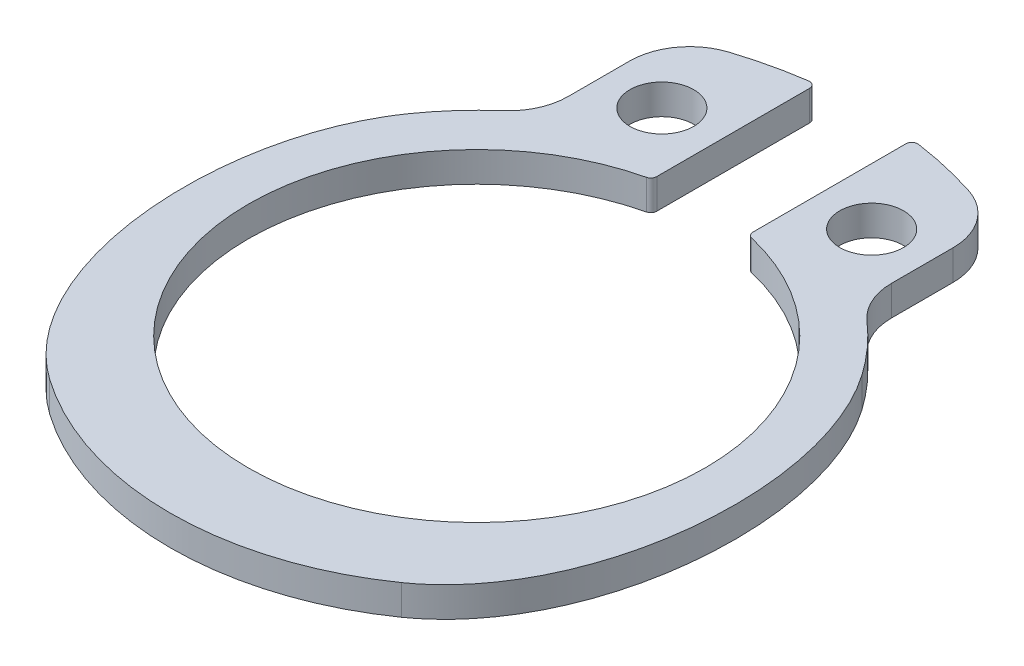
ISO-10303-21;
HEADER;
FILE_DESCRIPTION(('STEP AP214'),'2;1');
FILE_NAME('part.step','',(''),(''),'','','');
FILE_SCHEMA(('AUTOMOTIVE_DESIGN { 1 0 10303 214 1 1 1 1 }'));
ENDSEC;
DATA;
#1=APPLICATION_CONTEXT('core data for automotive mechanical design processes');
#2=APPLICATION_PROTOCOL_DEFINITION('international standard','automotive_design',2000,#1);
#3=PRODUCT_CONTEXT('',#1,'mechanical');
#4=PRODUCT('Part','Part','',(#3));
#5=PRODUCT_RELATED_PRODUCT_CATEGORY('part','',(#4));
#6=PRODUCT_DEFINITION_FORMATION('','',#4);
#7=PRODUCT_DEFINITION_CONTEXT('part definition',#1,'design');
#8=PRODUCT_DEFINITION('design','',#6,#7);
#9=PRODUCT_DEFINITION_SHAPE('','',#8);
#10=(LENGTH_UNIT() NAMED_UNIT(*) SI_UNIT(.MILLI.,.METRE.));
#11=(NAMED_UNIT(*) PLANE_ANGLE_UNIT() SI_UNIT($,.RADIAN.));
#12=(NAMED_UNIT(*) SI_UNIT($,.STERADIAN.) SOLID_ANGLE_UNIT());
#13=UNCERTAINTY_MEASURE_WITH_UNIT(LENGTH_MEASURE(1.E-05),#10,'distance_accuracy_value','');
#14=(GEOMETRIC_REPRESENTATION_CONTEXT(3) GLOBAL_UNCERTAINTY_ASSIGNED_CONTEXT((#13)) GLOBAL_UNIT_ASSIGNED_CONTEXT((#10,
#11,#12)) REPRESENTATION_CONTEXT('',''));
#15=CARTESIAN_POINT('',(0.,0.,0.));
#16=DIRECTION('',(0.,0.,1.));
#17=DIRECTION('',(1.,0.,0.));
#18=AXIS2_PLACEMENT_3D('',#15,#16,#17);
#19=CARTESIAN_POINT('',(-0.45,-0.125,-3.168201382488));
#20=DIRECTION('',(0.,1.,0.));
#21=DIRECTION('',(0.,0.,-1.));
#22=AXIS2_PLACEMENT_3D('',#19,#20,#21);
#23=CYLINDRICAL_SURFACE('',#22,0.0500000000000001);
#24=CARTESIAN_POINT('',(-0.45,0.125,-3.168201382488));
#25=DIRECTION('',(0.,-1.,0.));
#26=DIRECTION('',(0.,0.,-1.));
#27=AXIS2_PLACEMENT_3D('',#24,#25,#26);
#28=CIRCLE('',#27,0.0500000000000001);
#29=CARTESIAN_POINT('',(-0.457031249999959,0.125,-3.21770452908938));
#30=VERTEX_POINT('',#29);
#31=CARTESIAN_POINT('',(-0.4,0.125,-3.168201382488));
#32=VERTEX_POINT('',#31);
#33=EDGE_CURVE('E205',#30,#32,#28,.T.);
#34=ORIENTED_EDGE('',*,*,#33,.T.);
#35=DIRECTION('',(0.,1.,0.));
#36=VECTOR('',#35,1.);
#37=CARTESIAN_POINT('',(-0.4,-0.125,-3.168201382488));
#38=LINE('',#37,#36);
#39=CARTESIAN_POINT('',(-0.4,-0.125,-3.168201382488));
#40=VERTEX_POINT('',#39);
#41=EDGE_CURVE('E40',#40,#32,#38,.T.);
#42=ORIENTED_EDGE('',*,*,#41,.F.);
#43=CARTESIAN_POINT('',(-0.45,-0.125,-3.168201382488));
#44=DIRECTION('',(0.,-1.,0.));
#45=DIRECTION('',(0.,0.,-1.));
#46=AXIS2_PLACEMENT_3D('',#43,#44,#45);
#47=CIRCLE('',#46,0.0500000000000001);
#48=CARTESIAN_POINT('',(-0.457031249999959,-0.125,-3.21770452908938));
#49=VERTEX_POINT('',#48);
#50=EDGE_CURVE('E253',#49,#40,#47,.T.);
#51=ORIENTED_EDGE('',*,*,#50,.F.);
#52=DIRECTION('',(0.,1.,0.));
#53=VECTOR('',#52,1.);
#54=CARTESIAN_POINT('',(-0.457031249999959,-0.125,-3.21770452908938));
#55=LINE('',#54,#53);
#56=EDGE_CURVE('E11',#49,#30,#55,.T.);
#57=ORIENTED_EDGE('',*,*,#56,.T.);
#58=EDGE_LOOP('',(#34,#42,#51,#57));
#59=FACE_BOUND('',#58,.T.);
#60=ADVANCED_FACE('F37',(#59),#23,.T.);
#61=CARTESIAN_POINT('',(0.,-0.125,0.));
#62=DIRECTION('',(0.,1.,0.));
#63=DIRECTION('',(0.,0.,-1.));
#64=AXIS2_PLACEMENT_3D('',#61,#62,#63);
#65=CYLINDRICAL_SURFACE('',#64,3.24999999999982);
#66=CARTESIAN_POINT('',(0.,0.125,0.));
#67=DIRECTION('',(0.,-1.,0.));
#68=DIRECTION('',(0.,0.,-1.));
#69=AXIS2_PLACEMENT_3D('',#66,#67,#68);
#70=CIRCLE('',#69,3.24999999999982);
#71=CARTESIAN_POINT('',(-0.998636363636399,0.125,-3.0927698610181));
#72=VERTEX_POINT('',#71);
#73=EDGE_CURVE('E126',#72,#30,#70,.T.);
#74=ORIENTED_EDGE('',*,*,#73,.T.);
#75=ORIENTED_EDGE('',*,*,#56,.F.);
#76=CARTESIAN_POINT('',(0.,-0.125,0.));
#77=DIRECTION('',(0.,-1.,0.));
#78=DIRECTION('',(0.,0.,-1.));
#79=AXIS2_PLACEMENT_3D('',#76,#77,#78);
#80=CIRCLE('',#79,3.24999999999982);
#81=CARTESIAN_POINT('',(-0.998636363636399,-0.125,-3.0927698610181));
#82=VERTEX_POINT('',#81);
#83=EDGE_CURVE('E55',#82,#49,#80,.T.);
#84=ORIENTED_EDGE('',*,*,#83,.F.);
#85=DIRECTION('',(0.,1.,0.));
#86=VECTOR('',#85,1.);
#87=CARTESIAN_POINT('',(-0.998636363636399,-0.125,-3.0927698610181));
#88=LINE('',#87,#86);
#89=EDGE_CURVE('E46',#82,#72,#88,.T.);
#90=ORIENTED_EDGE('',*,*,#89,.T.);
#91=EDGE_LOOP('',(#74,#75,#84,#90));
#92=FACE_BOUND('',#91,.T.);
#93=ADVANCED_FACE('F401',(#92),#65,.T.);
#94=CARTESIAN_POINT('',(-0.845,-0.125,-2.616959113169));
#95=DIRECTION('',(0.,1.,0.));
#96=DIRECTION('',(0.,0.,-1.));
#97=AXIS2_PLACEMENT_3D('',#94,#95,#96);
#98=CYLINDRICAL_SURFACE('',#97,0.500000000000134);
#99=CARTESIAN_POINT('',(-0.845,0.125,-2.616959113169));
#100=DIRECTION('',(0.,-1.,0.));
#101=DIRECTION('',(0.,0.,-1.));
#102=AXIS2_PLACEMENT_3D('',#99,#100,#101);
#103=CIRCLE('',#102,0.500000000000134);
#104=CARTESIAN_POINT('',(-1.34500000000013,0.125,-2.61695911316899));
#105=VERTEX_POINT('',#104);
#106=EDGE_CURVE('E120',#105,#72,#103,.T.);
#107=ORIENTED_EDGE('',*,*,#106,.T.);
#108=ORIENTED_EDGE('',*,*,#89,.F.);
#109=CARTESIAN_POINT('',(-0.845,-0.125,-2.616959113169));
#110=DIRECTION('',(0.,-1.,0.));
#111=DIRECTION('',(0.,0.,-1.));
#112=AXIS2_PLACEMENT_3D('',#109,#110,#111);
#113=CIRCLE('',#112,0.500000000000134);
#114=CARTESIAN_POINT('',(-1.34500000000013,-0.125,-2.61695911316899));
#115=VERTEX_POINT('',#114);
#116=EDGE_CURVE('E187',#115,#82,#113,.T.);
#117=ORIENTED_EDGE('',*,*,#116,.F.);
#118=DIRECTION('',(0.,1.,0.));
#119=VECTOR('',#118,1.);
#120=CARTESIAN_POINT('',(-1.34500000000013,-0.125,-2.61695911316899));
#121=LINE('',#120,#119);
#122=EDGE_CURVE('E194',#115,#105,#121,.T.);
#123=ORIENTED_EDGE('',*,*,#122,.T.);
#124=EDGE_LOOP('',(#107,#108,#117,#123));
#125=FACE_BOUND('',#124,.T.);
#126=ADVANCED_FACE('F200',(#125),#98,.T.);
#127=CARTESIAN_POINT('',(-1.34500000000013,-0.125,-2.10617544378409));
#128=DIRECTION('',(-1.,0.,0.));
#129=DIRECTION('',(0.,0.,-1.));
#130=AXIS2_PLACEMENT_3D('',#127,#128,#129);
#131=PLANE('',#130);
#132=DIRECTION('',(0.,0.,-1.));
#133=VECTOR('',#132,1.);
#134=CARTESIAN_POINT('',(-1.34500000000013,0.125,-2.10617544378409));
#135=LINE('',#134,#133);
#136=CARTESIAN_POINT('',(-1.34500000000013,0.125,-2.10617544378409));
#137=VERTEX_POINT('',#136);
#138=EDGE_CURVE('E197',#137,#105,#135,.T.);
#139=ORIENTED_EDGE('',*,*,#138,.T.);
#140=ORIENTED_EDGE('',*,*,#122,.F.);
#141=DIRECTION('',(0.,0.,-1.));
#142=VECTOR('',#141,1.);
#143=CARTESIAN_POINT('',(-1.34500000000013,-0.125,-2.10617544378409));
#144=LINE('',#143,#142);
#145=CARTESIAN_POINT('',(-1.34500000000013,-0.125,-2.10617544378409));
#146=VERTEX_POINT('',#145);
#147=EDGE_CURVE('E183',#146,#115,#144,.T.);
#148=ORIENTED_EDGE('',*,*,#147,.F.);
#149=DIRECTION('',(0.,1.,0.));
#150=VECTOR('',#149,1.);
#151=CARTESIAN_POINT('',(-1.34500000000013,-0.125,-2.10617544378409));
#152=LINE('',#151,#150);
#153=EDGE_CURVE('E198',#146,#137,#152,.T.);
#154=ORIENTED_EDGE('',*,*,#153,.T.);
#155=EDGE_LOOP('',(#139,#140,#148,#154));
#156=FACE_BOUND('',#155,.T.);
#157=ADVANCED_FACE('F195',(#156),#131,.T.);
#158=CARTESIAN_POINT('',(-1.84500000000007,-0.125,-2.10617544378409));
#159=DIRECTION('',(0.,1.,0.));
#160=DIRECTION('',(0.,0.,-1.));
#161=AXIS2_PLACEMENT_3D('',#158,#159,#160);
#162=CYLINDRICAL_SURFACE('',#161,0.499999999999943);
#163=CARTESIAN_POINT('',(-1.84500000000007,0.125,-2.10617544378409));
#164=DIRECTION('',(0.,1.,0.));
#165=DIRECTION('',(0.,0.,1.));
#166=AXIS2_PLACEMENT_3D('',#163,#164,#165);
#167=CIRCLE('',#166,0.499999999999943);
#168=CARTESIAN_POINT('',(-1.51553571428582,0.125,-1.73007268596555));
#169=VERTEX_POINT('',#168);
#170=EDGE_CURVE('E249',#169,#137,#167,.T.);
#171=ORIENTED_EDGE('',*,*,#170,.T.);
#172=ORIENTED_EDGE('',*,*,#153,.F.);
#173=CARTESIAN_POINT('',(-1.84500000000007,-0.125,-2.10617544378409));
#174=DIRECTION('',(0.,1.,0.));
#175=DIRECTION('',(0.,0.,1.));
#176=AXIS2_PLACEMENT_3D('',#173,#174,#175);
#177=CIRCLE('',#176,0.499999999999943);
#178=CARTESIAN_POINT('',(-1.51553571428582,-0.125,-1.73007268596555));
#179=VERTEX_POINT('',#178);
#180=EDGE_CURVE('E189',#179,#146,#177,.T.);
#181=ORIENTED_EDGE('',*,*,#180,.F.);
#182=DIRECTION('',(0.,1.,0.));
#183=VECTOR('',#182,1.);
#184=CARTESIAN_POINT('',(-1.51553571428582,-0.125,-1.73007268596555));
#185=LINE('',#184,#183);
#186=EDGE_CURVE('E257',#179,#169,#185,.T.);
#187=ORIENTED_EDGE('',*,*,#186,.T.);
#188=EDGE_LOOP('',(#171,#172,#181,#187));
#189=FACE_BOUND('',#188,.T.);
#190=ADVANCED_FACE('F414',(#189),#162,.F.);
#191=CARTESIAN_POINT('',(0.,-0.125,0.));
#192=DIRECTION('',(0.,1.,0.));
#193=DIRECTION('',(0.,0.,-1.));
#194=AXIS2_PLACEMENT_3D('',#191,#192,#193);
#195=CYLINDRICAL_SURFACE('',#194,2.29999999999997);
#196=CARTESIAN_POINT('',(0.,0.125,0.));
#197=DIRECTION('',(0.,-1.,0.));
#198=DIRECTION('',(0.,0.,-1.));
#199=AXIS2_PLACEMENT_3D('',#196,#197,#198);
#200=CIRCLE('',#199,2.29999999999997);
#201=CARTESIAN_POINT('',(-1.88404970186493,0.125,-1.31922580360695));
#202=VERTEX_POINT('',#201);
#203=EDGE_CURVE('E244',#202,#169,#200,.T.);
#204=ORIENTED_EDGE('',*,*,#203,.T.);
#205=ORIENTED_EDGE('',*,*,#186,.F.);
#206=CARTESIAN_POINT('',(0.,-0.125,0.));
#207=DIRECTION('',(0.,-1.,0.));
#208=DIRECTION('',(0.,0.,-1.));
#209=AXIS2_PLACEMENT_3D('',#206,#207,#208);
#210=CIRCLE('',#209,2.29999999999997);
#211=CARTESIAN_POINT('',(-1.88404970186493,-0.125,-1.31922580360695));
#212=VERTEX_POINT('',#211);
#213=EDGE_CURVE('E429',#212,#179,#210,.T.);
#214=ORIENTED_EDGE('',*,*,#213,.F.);
#215=DIRECTION('',(0.,1.,0.));
#216=VECTOR('',#215,1.);
#217=CARTESIAN_POINT('',(-1.88404970186493,-0.125,-1.31922580360695));
#218=LINE('',#217,#216);
#219=EDGE_CURVE('E260',#212,#202,#218,.T.);
#220=ORIENTED_EDGE('',*,*,#219,.T.);
#221=EDGE_LOOP('',(#204,#205,#214,#220));
#222=FACE_BOUND('',#221,.T.);
#223=ADVANCED_FACE('F417',(#222),#195,.T.);
#224=CARTESIAN_POINT('',(-1.46261991269529,-0.125,2.08883771293742));
#225=CARTESIAN_POINT('',(-1.6155306939898,-0.125,1.98176843120135));
#226=CARTESIAN_POINT('',(-1.74786933276423,-0.125,1.84200515271834));
#227=CARTESIAN_POINT('',(-1.85450095274819,-0.125,1.68878884892801));
#228=CARTESIAN_POINT('',(-1.99546026918019,-0.125,1.48624793796961));
#229=CARTESIAN_POINT('',(-2.0977800915544,-0.125,1.25460186872934));
#230=CARTESIAN_POINT('',(-2.16732858795415,-0.125,1.01784174508229));
#231=CARTESIAN_POINT('',(-2.26444958592378,-0.125,0.687218069829198));
#232=CARTESIAN_POINT('',(-2.30237871375998,-0.125,0.335122463083965));
#233=CARTESIAN_POINT('',(-2.28613934206715,-0.125,-0.00908791690405493));
#234=CARTESIAN_POINT('',(-2.26965827246097,-0.125,-0.358421335650343));
#235=CARTESIAN_POINT('',(-2.19677877389437,-0.125,-0.714119474283422));
#236=CARTESIAN_POINT('',(-2.04907703540922,-0.125,-1.03112051459212));
#237=CARTESIAN_POINT('',(-2.00233491356865,-0.125,-1.13143958599689));
#238=CARTESIAN_POINT('',(-1.94752972050468,-0.125,-1.22856694151852));
#239=CARTESIAN_POINT('',(-1.88404970186493,-0.125,-1.31922580360695));
#240=B_SPLINE_CURVE_WITH_KNOTS('',3,(#224,#225,#226,#227,#228,#229,#230,#231,#232,#233,#234,
#235,#236,#237,#238,#239),.UNSPECIFIED.,.F.,.F.,(4,3,3,3,3,4),(0.,0.000560008788456189,
0.00130088828889166,0.00233883949188015,0.00339561191091467,0.00372398774746972),.UNSPECIFIED.);
#241=DIRECTION('',(0.,1.,0.));
#242=VECTOR('',#241,1.);
#243=SURFACE_OF_LINEAR_EXTRUSION('',#240,#242);
#244=CARTESIAN_POINT('',(-1.46261991269529,0.125,2.08883771293742));
#245=CARTESIAN_POINT('',(-1.6155306939898,0.125,1.98176843120135));
#246=CARTESIAN_POINT('',(-1.74786933276423,0.125,1.84200515271834));
#247=CARTESIAN_POINT('',(-1.85450095274819,0.125,1.68878884892801));
#248=CARTESIAN_POINT('',(-1.99546026918019,0.125,1.48624793796961));
#249=CARTESIAN_POINT('',(-2.0977800915544,0.125,1.25460186872934));
#250=CARTESIAN_POINT('',(-2.16732858795415,0.125,1.01784174508229));
#251=CARTESIAN_POINT('',(-2.26444958592378,0.125,0.687218069829198));
#252=CARTESIAN_POINT('',(-2.30237871375998,0.125,0.335122463083965));
#253=CARTESIAN_POINT('',(-2.28613934206715,0.125,-0.00908791690405493));
#254=CARTESIAN_POINT('',(-2.26965827246097,0.125,-0.358421335650343));
#255=CARTESIAN_POINT('',(-2.19677877389437,0.125,-0.714119474283422));
#256=CARTESIAN_POINT('',(-2.04907703540922,0.125,-1.03112051459212));
#257=CARTESIAN_POINT('',(-2.00233491356865,0.125,-1.13143958599689));
#258=CARTESIAN_POINT('',(-1.94752972050468,0.125,-1.22856694151852));
#259=CARTESIAN_POINT('',(-1.88404970186493,0.125,-1.31922580360695));
#260=B_SPLINE_CURVE_WITH_KNOTS('',3,(#244,#245,#246,#247,#248,#249,#250,#251,#252,#253,#254,
#255,#256,#257,#258,#259),.UNSPECIFIED.,.F.,.F.,(4,3,3,3,3,4),(0.,0.000560008788456189,
0.00130088828889166,0.00233883949188015,0.00339561191091467,0.00372398774746972),.UNSPECIFIED.);
#261=CARTESIAN_POINT('',(-1.46261991269529,0.125,2.08883771293742));
#262=VERTEX_POINT('',#261);
#263=EDGE_CURVE('E240',#262,#202,#260,.T.);
#264=ORIENTED_EDGE('',*,*,#263,.T.);
#265=ORIENTED_EDGE('',*,*,#219,.F.);
#266=CARTESIAN_POINT('',(-1.46261991269529,-0.125,2.08883771293742));
#267=VERTEX_POINT('',#266);
#268=EDGE_CURVE('E424',#267,#212,#240,.T.);
#269=ORIENTED_EDGE('',*,*,#268,.F.);
#270=DIRECTION('',(0.,1.,0.));
#271=VECTOR('',#270,1.);
#272=CARTESIAN_POINT('',(-1.46261991269529,-0.125,2.08883771293742));
#273=LINE('',#272,#271);
#274=EDGE_CURVE('E263',#267,#262,#273,.T.);
#275=ORIENTED_EDGE('',*,*,#274,.T.);
#276=EDGE_LOOP('',(#264,#265,#269,#275));
#277=FACE_BOUND('',#276,.T.);
#278=ADVANCED_FACE('F420',(#277),#243,.F.);
#279=CARTESIAN_POINT('',(0.,-0.125,0.));
#280=DIRECTION('',(0.,1.,0.));
#281=DIRECTION('',(0.,0.,-1.));
#282=AXIS2_PLACEMENT_3D('',#279,#280,#281);
#283=CYLINDRICAL_SURFACE('',#282,2.55000000000047);
#284=CARTESIAN_POINT('',(0.,0.125,0.));
#285=DIRECTION('',(0.,-1.,0.));
#286=DIRECTION('',(0.,0.,-1.));
#287=AXIS2_PLACEMENT_3D('',#284,#285,#286);
#288=CIRCLE('',#287,2.55000000000047);
#289=CARTESIAN_POINT('',(1.46261991269531,0.125,2.08883771293741));
#290=VERTEX_POINT('',#289);
#291=EDGE_CURVE('E235',#290,#262,#288,.T.);
#292=ORIENTED_EDGE('',*,*,#291,.T.);
#293=ORIENTED_EDGE('',*,*,#274,.F.);
#294=CARTESIAN_POINT('',(0.,-0.125,0.));
#295=DIRECTION('',(0.,-1.,0.));
#296=DIRECTION('',(0.,0.,-1.));
#297=AXIS2_PLACEMENT_3D('',#294,#295,#296);
#298=CIRCLE('',#297,2.55000000000047);
#299=CARTESIAN_POINT('',(1.46261991269531,-0.125,2.08883771293741));
#300=VERTEX_POINT('',#299);
#301=EDGE_CURVE('E346',#300,#267,#298,.T.);
#302=ORIENTED_EDGE('',*,*,#301,.F.);
#303=DIRECTION('',(0.,1.,0.));
#304=VECTOR('',#303,1.);
#305=CARTESIAN_POINT('',(1.46261991269531,-0.125,2.08883771293741));
#306=LINE('',#305,#304);
#307=EDGE_CURVE('E266',#300,#290,#306,.T.);
#308=ORIENTED_EDGE('',*,*,#307,.T.);
#309=EDGE_LOOP('',(#292,#293,#302,#308));
#310=FACE_BOUND('',#309,.T.);
#311=ADVANCED_FACE('F357',(#310),#283,.T.);
#312=CARTESIAN_POINT('',(1.88404970186525,-0.125,-1.3192258036065));
#313=CARTESIAN_POINT('',(2.01902897506243,-0.125,-1.1264554236381));
#314=CARTESIAN_POINT('',(2.11511016190428,-0.125,-0.904375316196927));
#315=CARTESIAN_POINT('',(2.17946032705223,-0.125,-0.6780152494196));
#316=CARTESIAN_POINT('',(2.27015310436415,-0.125,-0.358991621720318));
#317=CARTESIAN_POINT('',(2.30250122825986,-0.125,-0.0198992452615869));
#318=CARTESIAN_POINT('',(2.28538737439286,-0.125,0.31132329457044));
#319=CARTESIAN_POINT('',(2.26784311952617,-0.125,0.650875840803742));
#320=CARTESIAN_POINT('',(2.19755107846837,-0.125,0.994363091037852));
#321=CARTESIAN_POINT('',(2.06391741811087,-0.125,1.30700630198574));
#322=CARTESIAN_POINT('',(1.98464505194974,-0.125,1.4924683108071));
#323=CARTESIAN_POINT('',(1.88078203974534,-0.125,1.67066980685565));
#324=CARTESIAN_POINT('',(1.75028858684848,-0.125,1.82446097534037));
#325=CARTESIAN_POINT('',(1.66602855769958,-0.125,1.92376441203929));
#326=CARTESIAN_POINT('',(1.56930145531106,-0.125,2.01413849261007));
#327=CARTESIAN_POINT('',(1.46261991269531,-0.125,2.08883771293741));
#328=B_SPLINE_CURVE_WITH_KNOTS('',3,(#312,#313,#314,#315,#316,#317,#318,#319,#320,#321,#322,
#323,#324,#325,#326,#327),.UNSPECIFIED.,.F.,.F.,(4,3,3,3,3,4),(0.,0.000705987543993548,
0.00170352357713237,0.00272765257922384,0.0033307815747171,0.00371830006365464),.UNSPECIFIED.);
#329=DIRECTION('',(0.,1.,0.));
#330=VECTOR('',#329,1.);
#331=SURFACE_OF_LINEAR_EXTRUSION('',#328,#330);
#332=CARTESIAN_POINT('',(1.88404970186525,0.125,-1.3192258036065));
#333=CARTESIAN_POINT('',(2.01902897506243,0.125,-1.1264554236381));
#334=CARTESIAN_POINT('',(2.11511016190428,0.125,-0.904375316196927));
#335=CARTESIAN_POINT('',(2.17946032705223,0.125,-0.6780152494196));
#336=CARTESIAN_POINT('',(2.27015310436415,0.125,-0.358991621720318));
#337=CARTESIAN_POINT('',(2.30250122825986,0.125,-0.0198992452615869));
#338=CARTESIAN_POINT('',(2.28538737439286,0.125,0.31132329457044));
#339=CARTESIAN_POINT('',(2.26784311952617,0.125,0.650875840803742));
#340=CARTESIAN_POINT('',(2.19755107846837,0.125,0.994363091037852));
#341=CARTESIAN_POINT('',(2.06391741811087,0.125,1.30700630198574));
#342=CARTESIAN_POINT('',(1.98464505194974,0.125,1.4924683108071));
#343=CARTESIAN_POINT('',(1.88078203974534,0.125,1.67066980685565));
#344=CARTESIAN_POINT('',(1.75028858684848,0.125,1.82446097534037));
#345=CARTESIAN_POINT('',(1.66602855769958,0.125,1.92376441203929));
#346=CARTESIAN_POINT('',(1.56930145531106,0.125,2.01413849261007));
#347=CARTESIAN_POINT('',(1.46261991269531,0.125,2.08883771293741));
#348=B_SPLINE_CURVE_WITH_KNOTS('',3,(#332,#333,#334,#335,#336,#337,#338,#339,#340,#341,#342,
#343,#344,#345,#346,#347),.UNSPECIFIED.,.F.,.F.,(4,3,3,3,3,4),(0.,0.000705987543993548,
0.00170352357713237,0.00272765257922384,0.0033307815747171,0.00371830006365464),.UNSPECIFIED.);
#349=CARTESIAN_POINT('',(1.88404970186525,0.125,-1.3192258036065));
#350=VERTEX_POINT('',#349);
#351=EDGE_CURVE('E231',#350,#290,#348,.T.);
#352=ORIENTED_EDGE('',*,*,#351,.T.);
#353=ORIENTED_EDGE('',*,*,#307,.F.);
#354=CARTESIAN_POINT('',(1.88404970186525,-0.125,-1.3192258036065));
#355=VERTEX_POINT('',#354);
#356=EDGE_CURVE('E341',#355,#300,#328,.T.);
#357=ORIENTED_EDGE('',*,*,#356,.F.);
#358=DIRECTION('',(0.,1.,0.));
#359=VECTOR('',#358,1.);
#360=CARTESIAN_POINT('',(1.88404970186525,-0.125,-1.3192258036065));
#361=LINE('',#360,#359);
#362=EDGE_CURVE('E269',#355,#350,#361,.T.);
#363=ORIENTED_EDGE('',*,*,#362,.T.);
#364=EDGE_LOOP('',(#352,#353,#357,#363));
#365=FACE_BOUND('',#364,.T.);
#366=ADVANCED_FACE('F352',(#365),#331,.F.);
#367=CARTESIAN_POINT('',(0.,-0.125,0.));
#368=DIRECTION('',(0.,1.,0.));
#369=DIRECTION('',(0.,0.,-1.));
#370=AXIS2_PLACEMENT_3D('',#367,#368,#369);
#371=CYLINDRICAL_SURFACE('',#370,2.29999999999994);
#372=CARTESIAN_POINT('',(0.,0.125,0.));
#373=DIRECTION('',(0.,-1.,0.));
#374=DIRECTION('',(0.,0.,-1.));
#375=AXIS2_PLACEMENT_3D('',#372,#373,#374);
#376=CIRCLE('',#375,2.29999999999994);
#377=CARTESIAN_POINT('',(1.51553571428579,0.125,-1.73007268596552));
#378=VERTEX_POINT('',#377);
#379=EDGE_CURVE('E229',#378,#350,#376,.T.);
#380=ORIENTED_EDGE('',*,*,#379,.T.);
#381=ORIENTED_EDGE('',*,*,#362,.F.);
#382=CARTESIAN_POINT('',(0.,-0.125,0.));
#383=DIRECTION('',(0.,-1.,0.));
#384=DIRECTION('',(0.,0.,-1.));
#385=AXIS2_PLACEMENT_3D('',#382,#383,#384);
#386=CIRCLE('',#385,2.29999999999994);
#387=CARTESIAN_POINT('',(1.51553571428579,-0.125,-1.73007268596552));
#388=VERTEX_POINT('',#387);
#389=EDGE_CURVE('E339',#388,#355,#386,.T.);
#390=ORIENTED_EDGE('',*,*,#389,.F.);
#391=DIRECTION('',(0.,1.,0.));
#392=VECTOR('',#391,1.);
#393=CARTESIAN_POINT('',(1.51553571428579,-0.125,-1.73007268596552));
#394=LINE('',#393,#392);
#395=EDGE_CURVE('E272',#388,#378,#394,.T.);
#396=ORIENTED_EDGE('',*,*,#395,.T.);
#397=EDGE_LOOP('',(#380,#381,#390,#396));
#398=FACE_BOUND('',#397,.T.);
#399=ADVANCED_FACE('F356',(#398),#371,.T.);
#400=CARTESIAN_POINT('',(1.845,-0.125,-2.106175443784));
#401=DIRECTION('',(0.,1.,0.));
#402=DIRECTION('',(0.,0.,-1.));
#403=AXIS2_PLACEMENT_3D('',#400,#401,#402);
#404=CYLINDRICAL_SURFACE('',#403,0.499999999999839);
#405=CARTESIAN_POINT('',(1.845,0.125,-2.106175443784));
#406=DIRECTION('',(0.,1.,0.));
#407=DIRECTION('',(0.,0.,1.));
#408=AXIS2_PLACEMENT_3D('',#405,#406,#407);
#409=CIRCLE('',#408,0.499999999999839);
#410=CARTESIAN_POINT('',(1.34500000000015,0.125,-2.10617544378404));
#411=VERTEX_POINT('',#410);
#412=EDGE_CURVE('E227',#411,#378,#409,.T.);
#413=ORIENTED_EDGE('',*,*,#412,.T.);
#414=ORIENTED_EDGE('',*,*,#395,.F.);
#415=CARTESIAN_POINT('',(1.845,-0.125,-2.106175443784));
#416=DIRECTION('',(0.,1.,0.));
#417=DIRECTION('',(0.,0.,1.));
#418=AXIS2_PLACEMENT_3D('',#415,#416,#417);
#419=CIRCLE('',#418,0.499999999999839);
#420=CARTESIAN_POINT('',(1.34500000000015,-0.125,-2.10617544378404));
#421=VERTEX_POINT('',#420);
#422=EDGE_CURVE('E337',#421,#388,#419,.T.);
#423=ORIENTED_EDGE('',*,*,#422,.F.);
#424=DIRECTION('',(0.,1.,0.));
#425=VECTOR('',#424,1.);
#426=CARTESIAN_POINT('',(1.34500000000015,-0.125,-2.10617544378404));
#427=LINE('',#426,#425);
#428=EDGE_CURVE('E275',#421,#411,#427,.T.);
#429=ORIENTED_EDGE('',*,*,#428,.T.);
#430=EDGE_LOOP('',(#413,#414,#423,#429));
#431=FACE_BOUND('',#430,.T.);
#432=ADVANCED_FACE('F362',(#431),#404,.F.);
#433=CARTESIAN_POINT('',(1.34500000000015,-0.125,-2.6169591131691));
#434=DIRECTION('',(1.,0.,0.));
#435=DIRECTION('',(0.,0.,1.));
#436=AXIS2_PLACEMENT_3D('',#433,#434,#435);
#437=PLANE('',#436);
#438=DIRECTION('',(0.,0.,1.));
#439=VECTOR('',#438,1.);
#440=CARTESIAN_POINT('',(1.34500000000015,0.125,-2.6169591131691));
#441=LINE('',#440,#439);
#442=CARTESIAN_POINT('',(1.34500000000015,0.125,-2.6169591131691));
#443=VERTEX_POINT('',#442);
#444=EDGE_CURVE('E225',#443,#411,#441,.T.);
#445=ORIENTED_EDGE('',*,*,#444,.T.);
#446=ORIENTED_EDGE('',*,*,#428,.F.);
#447=DIRECTION('',(0.,0.,1.));
#448=VECTOR('',#447,1.);
#449=CARTESIAN_POINT('',(1.34500000000015,-0.125,-2.6169591131691));
#450=LINE('',#449,#448);
#451=CARTESIAN_POINT('',(1.34500000000015,-0.125,-2.6169591131691));
#452=VERTEX_POINT('',#451);
#453=EDGE_CURVE('E335',#452,#421,#450,.T.);
#454=ORIENTED_EDGE('',*,*,#453,.F.);
#455=DIRECTION('',(0.,1.,0.));
#456=VECTOR('',#455,1.);
#457=CARTESIAN_POINT('',(1.34500000000015,-0.125,-2.6169591131691));
#458=LINE('',#457,#456);
#459=EDGE_CURVE('E278',#452,#443,#458,.T.);
#460=ORIENTED_EDGE('',*,*,#459,.T.);
#461=EDGE_LOOP('',(#445,#446,#454,#460));
#462=FACE_BOUND('',#461,.T.);
#463=ADVANCED_FACE('F366',(#462),#437,.T.);
#464=CARTESIAN_POINT('',(0.845000000000151,-0.125,-2.6169591131691));
#465=DIRECTION('',(0.,1.,0.));
#466=DIRECTION('',(0.,0.,-1.));
#467=AXIS2_PLACEMENT_3D('',#464,#465,#466);
#468=CYLINDRICAL_SURFACE('',#467,0.5);
#469=CARTESIAN_POINT('',(0.845000000000151,0.125,-2.6169591131691));
#470=DIRECTION('',(0.,-1.,0.));
#471=DIRECTION('',(0.,0.,-1.));
#472=AXIS2_PLACEMENT_3D('',#469,#470,#471);
#473=CIRCLE('',#472,0.5);
#474=CARTESIAN_POINT('',(0.998636363636553,0.125,-3.09276986101805));
#475=VERTEX_POINT('',#474);
#476=EDGE_CURVE('E223',#475,#443,#473,.T.);
#477=ORIENTED_EDGE('',*,*,#476,.T.);
#478=ORIENTED_EDGE('',*,*,#459,.F.);
#479=CARTESIAN_POINT('',(0.845000000000151,-0.125,-2.6169591131691));
#480=DIRECTION('',(0.,-1.,0.));
#481=DIRECTION('',(0.,0.,-1.));
#482=AXIS2_PLACEMENT_3D('',#479,#480,#481);
#483=CIRCLE('',#482,0.5);
#484=CARTESIAN_POINT('',(0.998636363636553,-0.125,-3.09276986101805));
#485=VERTEX_POINT('',#484);
#486=EDGE_CURVE('E333',#485,#452,#483,.T.);
#487=ORIENTED_EDGE('',*,*,#486,.F.);
#488=DIRECTION('',(0.,1.,0.));
#489=VECTOR('',#488,1.);
#490=CARTESIAN_POINT('',(0.998636363636553,-0.125,-3.09276986101805));
#491=LINE('',#490,#489);
#492=EDGE_CURVE('E281',#485,#475,#491,.T.);
#493=ORIENTED_EDGE('',*,*,#492,.T.);
#494=EDGE_LOOP('',(#477,#478,#487,#493));
#495=FACE_BOUND('',#494,.T.);
#496=ADVANCED_FACE('F370',(#495),#468,.T.);
#497=CARTESIAN_POINT('',(0.,-0.125,0.));
#498=DIRECTION('',(0.,1.,0.));
#499=DIRECTION('',(0.,0.,-1.));
#500=AXIS2_PLACEMENT_3D('',#497,#498,#499);
#501=CYLINDRICAL_SURFACE('',#500,3.24999999999983);
#502=CARTESIAN_POINT('',(0.,0.125,0.));
#503=DIRECTION('',(0.,-1.,0.));
#504=DIRECTION('',(0.,0.,-1.));
#505=AXIS2_PLACEMENT_3D('',#502,#503,#504);
#506=CIRCLE('',#505,3.24999999999983);
#507=CARTESIAN_POINT('',(0.457031250000104,0.125,-3.21770452908936));
#508=VERTEX_POINT('',#507);
#509=EDGE_CURVE('E221',#508,#475,#506,.T.);
#510=ORIENTED_EDGE('',*,*,#509,.T.);
#511=ORIENTED_EDGE('',*,*,#492,.F.);
#512=CARTESIAN_POINT('',(0.,-0.125,0.));
#513=DIRECTION('',(0.,-1.,0.));
#514=DIRECTION('',(0.,0.,-1.));
#515=AXIS2_PLACEMENT_3D('',#512,#513,#514);
#516=CIRCLE('',#515,3.24999999999983);
#517=CARTESIAN_POINT('',(0.457031250000104,-0.125,-3.21770452908936));
#518=VERTEX_POINT('',#517);
#519=EDGE_CURVE('E331',#518,#485,#516,.T.);
#520=ORIENTED_EDGE('',*,*,#519,.F.);
#521=DIRECTION('',(0.,1.,0.));
#522=VECTOR('',#521,1.);
#523=CARTESIAN_POINT('',(0.457031250000104,-0.125,-3.21770452908936));
#524=LINE('',#523,#522);
#525=EDGE_CURVE('E284',#518,#508,#524,.T.);
#526=ORIENTED_EDGE('',*,*,#525,.T.);
#527=EDGE_LOOP('',(#510,#511,#520,#526));
#528=FACE_BOUND('',#527,.T.);
#529=ADVANCED_FACE('F374',(#528),#501,.T.);
#530=CARTESIAN_POINT('',(0.450000000000089,-0.125,-3.1682013824879));
#531=DIRECTION('',(0.,1.,0.));
#532=DIRECTION('',(0.,0.,-1.));
#533=AXIS2_PLACEMENT_3D('',#530,#531,#532);
#534=CYLINDRICAL_SURFACE('',#533,0.0500000000000879);
#535=CARTESIAN_POINT('',(0.450000000000089,0.125,-3.1682013824879));
#536=DIRECTION('',(0.,-1.,0.));
#537=DIRECTION('',(0.,0.,-1.));
#538=AXIS2_PLACEMENT_3D('',#535,#536,#537);
#539=CIRCLE('',#538,0.0500000000000879);
#540=CARTESIAN_POINT('',(0.400000000000001,0.125,-3.1682013824879));
#541=VERTEX_POINT('',#540);
#542=EDGE_CURVE('E219',#541,#508,#539,.T.);
#543=ORIENTED_EDGE('',*,*,#542,.T.);
#544=ORIENTED_EDGE('',*,*,#525,.F.);
#545=CARTESIAN_POINT('',(0.450000000000089,-0.125,-3.1682013824879));
#546=DIRECTION('',(0.,-1.,0.));
#547=DIRECTION('',(0.,0.,-1.));
#548=AXIS2_PLACEMENT_3D('',#545,#546,#547);
#549=CIRCLE('',#548,0.0500000000000879);
#550=CARTESIAN_POINT('',(0.400000000000001,-0.125,-3.1682013824879));
#551=VERTEX_POINT('',#550);
#552=EDGE_CURVE('E329',#551,#518,#549,.T.);
#553=ORIENTED_EDGE('',*,*,#552,.F.);
#554=DIRECTION('',(0.,1.,0.));
#555=VECTOR('',#554,1.);
#556=CARTESIAN_POINT('',(0.400000000000001,-0.125,-3.1682013824879));
#557=LINE('',#556,#555);
#558=EDGE_CURVE('E287',#551,#541,#557,.T.);
#559=ORIENTED_EDGE('',*,*,#558,.T.);
#560=EDGE_LOOP('',(#543,#544,#553,#559));
#561=FACE_BOUND('',#560,.T.);
#562=ADVANCED_FACE('F378',(#561),#534,.T.);
#563=CARTESIAN_POINT('',(0.4,-0.125,-1.897366596101));
#564=DIRECTION('',(-1.,0.,0.));
#565=DIRECTION('',(0.,0.,-1.));
#566=AXIS2_PLACEMENT_3D('',#563,#564,#565);
#567=PLANE('',#566);
#568=DIRECTION('',(0.,0.,-1.));
#569=VECTOR('',#568,1.);
#570=CARTESIAN_POINT('',(0.4,0.125,-1.897366596101));
#571=LINE('',#570,#569);
#572=CARTESIAN_POINT('',(0.4,0.125,-1.897366596101));
#573=VERTEX_POINT('',#572);
#574=EDGE_CURVE('E217',#573,#541,#571,.T.);
#575=ORIENTED_EDGE('',*,*,#574,.T.);
#576=ORIENTED_EDGE('',*,*,#558,.F.);
#577=DIRECTION('',(0.,0.,-1.));
#578=VECTOR('',#577,1.);
#579=CARTESIAN_POINT('',(0.4,-0.125,-1.897366596101));
#580=LINE('',#579,#578);
#581=CARTESIAN_POINT('',(0.4,-0.125,-1.897366596101));
#582=VERTEX_POINT('',#581);
#583=EDGE_CURVE('E323',#582,#551,#580,.T.);
#584=ORIENTED_EDGE('',*,*,#583,.F.);
#585=DIRECTION('',(0.,1.,0.));
#586=VECTOR('',#585,1.);
#587=CARTESIAN_POINT('',(0.4,-0.125,-1.897366596101));
#588=LINE('',#587,#586);
#589=EDGE_CURVE('E290',#582,#573,#588,.T.);
#590=ORIENTED_EDGE('',*,*,#589,.T.);
#591=EDGE_LOOP('',(#575,#576,#584,#590));
#592=FACE_BOUND('',#591,.T.);
#593=ADVANCED_FACE('F382',(#592),#567,.T.);
#594=CARTESIAN_POINT('',(0.45,-0.125,-1.897366596101));
#595=DIRECTION('',(0.,1.,0.));
#596=DIRECTION('',(0.,0.,-1.));
#597=AXIS2_PLACEMENT_3D('',#594,#595,#596);
#598=CYLINDRICAL_SURFACE('',#597,0.05);
#599=CARTESIAN_POINT('',(0.45,0.125,-1.897366596101));
#600=DIRECTION('',(0.,-1.,0.));
#601=DIRECTION('',(0.,0.,-1.));
#602=AXIS2_PLACEMENT_3D('',#599,#600,#601);
#603=CIRCLE('',#602,0.05);
#604=CARTESIAN_POINT('',(0.438461538461517,0.125,-1.84871617055996));
#605=VERTEX_POINT('',#604);
#606=EDGE_CURVE('E215',#605,#573,#603,.T.);
#607=ORIENTED_EDGE('',*,*,#606,.T.);
#608=ORIENTED_EDGE('',*,*,#589,.F.);
#609=CARTESIAN_POINT('',(0.45,-0.125,-1.897366596101));
#610=DIRECTION('',(0.,-1.,0.));
#611=DIRECTION('',(0.,0.,-1.));
#612=AXIS2_PLACEMENT_3D('',#609,#610,#611);
#613=CIRCLE('',#612,0.05);
#614=CARTESIAN_POINT('',(0.438461538461517,-0.125,-1.84871617055996));
#615=VERTEX_POINT('',#614);
#616=EDGE_CURVE('E320',#615,#582,#613,.T.);
#617=ORIENTED_EDGE('',*,*,#616,.F.);
#618=DIRECTION('',(0.,1.,0.));
#619=VECTOR('',#618,1.);
#620=CARTESIAN_POINT('',(0.438461538461517,-0.125,-1.84871617055996));
#621=LINE('',#620,#619);
#622=EDGE_CURVE('E293',#615,#605,#621,.T.);
#623=ORIENTED_EDGE('',*,*,#622,.T.);
#624=EDGE_LOOP('',(#607,#608,#617,#623));
#625=FACE_BOUND('',#624,.T.);
#626=ADVANCED_FACE('F386',(#625),#598,.T.);
#627=CARTESIAN_POINT('',(0.,-0.125,0.));
#628=DIRECTION('',(0.,1.,0.));
#629=DIRECTION('',(0.,0.,-1.));
#630=AXIS2_PLACEMENT_3D('',#627,#628,#629);
#631=CYLINDRICAL_SURFACE('',#630,1.89999999999998);
#632=CARTESIAN_POINT('',(0.,0.125,0.));
#633=DIRECTION('',(0.,1.,0.));
#634=DIRECTION('',(0.,0.,1.));
#635=AXIS2_PLACEMENT_3D('',#632,#633,#634);
#636=CIRCLE('',#635,1.89999999999998);
#637=CARTESIAN_POINT('',(-0.438461538461516,0.125,-1.84871617055996));
#638=VERTEX_POINT('',#637);
#639=EDGE_CURVE('E213',#638,#605,#636,.T.);
#640=ORIENTED_EDGE('',*,*,#639,.T.);
#641=ORIENTED_EDGE('',*,*,#622,.F.);
#642=CARTESIAN_POINT('',(0.,-0.125,0.));
#643=DIRECTION('',(0.,1.,0.));
#644=DIRECTION('',(0.,0.,1.));
#645=AXIS2_PLACEMENT_3D('',#642,#643,#644);
#646=CIRCLE('',#645,1.89999999999998);
#647=CARTESIAN_POINT('',(-0.438461538461516,-0.125,-1.84871617055996));
#648=VERTEX_POINT('',#647);
#649=EDGE_CURVE('E318',#648,#615,#646,.T.);
#650=ORIENTED_EDGE('',*,*,#649,.F.);
#651=DIRECTION('',(0.,1.,0.));
#652=VECTOR('',#651,1.);
#653=CARTESIAN_POINT('',(-0.438461538461516,-0.125,-1.84871617055996));
#654=LINE('',#653,#652);
#655=EDGE_CURVE('E296',#648,#638,#654,.T.);
#656=ORIENTED_EDGE('',*,*,#655,.T.);
#657=EDGE_LOOP('',(#640,#641,#650,#656));
#658=FACE_BOUND('',#657,.T.);
#659=ADVANCED_FACE('F316',(#658),#631,.F.);
#660=CARTESIAN_POINT('',(-0.45,-0.125,-1.897366596101));
#661=DIRECTION('',(0.,1.,0.));
#662=DIRECTION('',(0.,0.,-1.));
#663=AXIS2_PLACEMENT_3D('',#660,#661,#662);
#664=CYLINDRICAL_SURFACE('',#663,0.0499999999999933);
#665=CARTESIAN_POINT('',(-0.45,0.125,-1.897366596101));
#666=DIRECTION('',(0.,-1.,0.));
#667=DIRECTION('',(0.,0.,-1.));
#668=AXIS2_PLACEMENT_3D('',#665,#666,#667);
#669=CIRCLE('',#668,0.0499999999999933);
#670=CARTESIAN_POINT('',(-0.4,0.125,-1.897366596101));
#671=VERTEX_POINT('',#670);
#672=EDGE_CURVE('E211',#671,#638,#669,.T.);
#673=ORIENTED_EDGE('',*,*,#672,.T.);
#674=ORIENTED_EDGE('',*,*,#655,.F.);
#675=CARTESIAN_POINT('',(-0.45,-0.125,-1.897366596101));
#676=DIRECTION('',(0.,-1.,0.));
#677=DIRECTION('',(0.,0.,-1.));
#678=AXIS2_PLACEMENT_3D('',#675,#676,#677);
#679=CIRCLE('',#678,0.0499999999999933);
#680=CARTESIAN_POINT('',(-0.4,-0.125,-1.897366596101));
#681=VERTEX_POINT('',#680);
#682=EDGE_CURVE('E321',#681,#648,#679,.T.);
#683=ORIENTED_EDGE('',*,*,#682,.F.);
#684=DIRECTION('',(0.,1.,0.));
#685=VECTOR('',#684,1.);
#686=CARTESIAN_POINT('',(-0.4,-0.125,-1.897366596101));
#687=LINE('',#686,#685);
#688=EDGE_CURVE('E298',#681,#671,#687,.T.);
#689=ORIENTED_EDGE('',*,*,#688,.T.);
#690=EDGE_LOOP('',(#673,#674,#683,#689));
#691=FACE_BOUND('',#690,.T.);
#692=ADVANCED_FACE('F313',(#691),#664,.T.);
#693=CARTESIAN_POINT('',(-0.4,-0.125,-3.168201382488));
#694=DIRECTION('',(1.,0.,0.));
#695=DIRECTION('',(0.,0.,1.));
#696=AXIS2_PLACEMENT_3D('',#693,#694,#695);
#697=PLANE('',#696);
#698=DIRECTION('',(0.,0.,1.));
#699=VECTOR('',#698,1.);
#700=CARTESIAN_POINT('',(-0.4,0.125,-3.168201382488));
#701=LINE('',#700,#699);
#702=EDGE_CURVE('E208',#32,#671,#701,.T.);
#703=ORIENTED_EDGE('',*,*,#702,.T.);
#704=ORIENTED_EDGE('',*,*,#688,.F.);
#705=DIRECTION('',(0.,0.,1.));
#706=VECTOR('',#705,1.);
#707=CARTESIAN_POINT('',(-0.4,-0.125,-3.168201382488));
#708=LINE('',#707,#706);
#709=EDGE_CURVE('E134',#40,#681,#708,.T.);
#710=ORIENTED_EDGE('',*,*,#709,.F.);
#711=ORIENTED_EDGE('',*,*,#41,.T.);
#712=EDGE_LOOP('',(#703,#704,#710,#711));
#713=FACE_BOUND('',#712,.T.);
#714=ADVANCED_FACE('F304',(#713),#697,.T.);
#715=CARTESIAN_POINT('',(-0.45,-0.125,-3.168201382488));
#716=DIRECTION('',(0.,1.,0.));
#717=DIRECTION('',(0.,0.,-1.));
#718=AXIS2_PLACEMENT_3D('',#715,#716,#717);
#719=PLANE('',#718);
#720=CARTESIAN_POINT('',(-0.8725,-0.125,-2.412182167598));
#721=DIRECTION('',(0.,-1.,0.));
#722=DIRECTION('',(0.,0.,1.));
#723=AXIS2_PLACEMENT_3D('',#720,#721,#722);
#724=CIRCLE('',#723,0.2651274938448);
#725=CARTESIAN_POINT('',(-0.8725,-0.125,-2.1470546737532));
#726=VERTEX_POINT('',#725);
#727=EDGE_CURVE('E563',#726,#726,#724,.T.);
#728=ORIENTED_EDGE('',*,*,#727,.F.);
#729=EDGE_LOOP('',(#728));
#730=FACE_BOUND('',#729,.T.);
#731=CARTESIAN_POINT('',(0.8725,-0.125,-2.412182167598));
#732=DIRECTION('',(0.,-1.,0.));
#733=DIRECTION('',(0.,0.,1.));
#734=AXIS2_PLACEMENT_3D('',#731,#732,#733);
#735=CIRCLE('',#734,0.2651274938448);
#736=CARTESIAN_POINT('',(0.8725,-0.125,-2.1470546737532));
#737=VERTEX_POINT('',#736);
#738=EDGE_CURVE('E209',#737,#737,#735,.T.);
#739=ORIENTED_EDGE('',*,*,#738,.F.);
#740=EDGE_LOOP('',(#739));
#741=FACE_BOUND('',#740,.T.);
#742=ORIENTED_EDGE('',*,*,#50,.T.);
#743=ORIENTED_EDGE('',*,*,#709,.T.);
#744=ORIENTED_EDGE('',*,*,#682,.T.);
#745=ORIENTED_EDGE('',*,*,#649,.T.);
#746=ORIENTED_EDGE('',*,*,#616,.T.);
#747=ORIENTED_EDGE('',*,*,#583,.T.);
#748=ORIENTED_EDGE('',*,*,#552,.T.);
#749=ORIENTED_EDGE('',*,*,#519,.T.);
#750=ORIENTED_EDGE('',*,*,#486,.T.);
#751=ORIENTED_EDGE('',*,*,#453,.T.);
#752=ORIENTED_EDGE('',*,*,#422,.T.);
#753=ORIENTED_EDGE('',*,*,#389,.T.);
#754=ORIENTED_EDGE('',*,*,#356,.T.);
#755=ORIENTED_EDGE('',*,*,#301,.T.);
#756=ORIENTED_EDGE('',*,*,#268,.T.);
#757=ORIENTED_EDGE('',*,*,#213,.T.);
#758=ORIENTED_EDGE('',*,*,#180,.T.);
#759=ORIENTED_EDGE('',*,*,#147,.T.);
#760=ORIENTED_EDGE('',*,*,#116,.T.);
#761=ORIENTED_EDGE('',*,*,#83,.T.);
#762=EDGE_LOOP('',(#742,#743,#744,#745,#746,#747,#748,#749,#750,#751,#752,#753,#754,#755,#756,
#757,#758,#759,#760,#761));
#763=FACE_BOUND('',#762,.T.);
#764=ADVANCED_FACE('F185',(#730,#741,#763),#719,.F.);
#765=CARTESIAN_POINT('',(-0.45,0.125,-3.168201382488));
#766=DIRECTION('',(0.,1.,0.));
#767=DIRECTION('',(0.,0.,-1.));
#768=AXIS2_PLACEMENT_3D('',#765,#766,#767);
#769=PLANE('',#768);
#770=CARTESIAN_POINT('',(-0.8725,0.125,-2.412182167598));
#771=DIRECTION('',(0.,-1.,0.));
#772=DIRECTION('',(0.,0.,1.));
#773=AXIS2_PLACEMENT_3D('',#770,#771,#772);
#774=CIRCLE('',#773,0.2651274938448);
#775=CARTESIAN_POINT('',(-0.8725,0.125,-2.1470546737532));
#776=VERTEX_POINT('',#775);
#777=EDGE_CURVE('E566',#776,#776,#774,.T.);
#778=ORIENTED_EDGE('',*,*,#777,.T.);
#779=EDGE_LOOP('',(#778));
#780=FACE_BOUND('',#779,.T.);
#781=CARTESIAN_POINT('',(0.8725,0.125,-2.412182167598));
#782=DIRECTION('',(0.,-1.,0.));
#783=DIRECTION('',(0.,0.,1.));
#784=AXIS2_PLACEMENT_3D('',#781,#782,#783);
#785=CIRCLE('',#784,0.2651274938448);
#786=CARTESIAN_POINT('',(0.8725,0.125,-2.1470546737532));
#787=VERTEX_POINT('',#786);
#788=EDGE_CURVE('E568',#787,#787,#785,.T.);
#789=ORIENTED_EDGE('',*,*,#788,.T.);
#790=EDGE_LOOP('',(#789));
#791=FACE_BOUND('',#790,.T.);
#792=ORIENTED_EDGE('',*,*,#33,.F.);
#793=ORIENTED_EDGE('',*,*,#73,.F.);
#794=ORIENTED_EDGE('',*,*,#106,.F.);
#795=ORIENTED_EDGE('',*,*,#138,.F.);
#796=ORIENTED_EDGE('',*,*,#170,.F.);
#797=ORIENTED_EDGE('',*,*,#203,.F.);
#798=ORIENTED_EDGE('',*,*,#263,.F.);
#799=ORIENTED_EDGE('',*,*,#291,.F.);
#800=ORIENTED_EDGE('',*,*,#351,.F.);
#801=ORIENTED_EDGE('',*,*,#379,.F.);
#802=ORIENTED_EDGE('',*,*,#412,.F.);
#803=ORIENTED_EDGE('',*,*,#444,.F.);
#804=ORIENTED_EDGE('',*,*,#476,.F.);
#805=ORIENTED_EDGE('',*,*,#509,.F.);
#806=ORIENTED_EDGE('',*,*,#542,.F.);
#807=ORIENTED_EDGE('',*,*,#574,.F.);
#808=ORIENTED_EDGE('',*,*,#606,.F.);
#809=ORIENTED_EDGE('',*,*,#639,.F.);
#810=ORIENTED_EDGE('',*,*,#672,.F.);
#811=ORIENTED_EDGE('',*,*,#702,.F.);
#812=EDGE_LOOP('',(#792,#793,#794,#795,#796,#797,#798,#799,#800,#801,#802,#803,#804,#805,#806,
#807,#808,#809,#810,#811));
#813=FACE_BOUND('',#812,.T.);
#814=ADVANCED_FACE('F309',(#780,#791,#813),#769,.T.);
#815=CARTESIAN_POINT('',(0.8725,-0.125,-2.412182167598));
#816=DIRECTION('',(0.,1.,0.));
#817=DIRECTION('',(0.,0.,-1.));
#818=AXIS2_PLACEMENT_3D('',#815,#816,#817);
#819=CYLINDRICAL_SURFACE('',#818,0.2651274938448);
#820=ORIENTED_EDGE('',*,*,#738,.T.);
#821=EDGE_LOOP('',(#820));
#822=FACE_BOUND('',#821,.T.);
#823=ORIENTED_EDGE('',*,*,#788,.F.);
#824=EDGE_LOOP('',(#823));
#825=FACE_BOUND('',#824,.T.);
#826=ADVANCED_FACE('F537',(#822,#825),#819,.F.);
#827=CARTESIAN_POINT('',(-0.8725,-0.125,-2.412182167598));
#828=DIRECTION('',(0.,1.,0.));
#829=DIRECTION('',(0.,0.,-1.));
#830=AXIS2_PLACEMENT_3D('',#827,#828,#829);
#831=CYLINDRICAL_SURFACE('',#830,0.2651274938448);
#832=ORIENTED_EDGE('',*,*,#727,.T.);
#833=EDGE_LOOP('',(#832));
#834=FACE_BOUND('',#833,.T.);
#835=ORIENTED_EDGE('',*,*,#777,.F.);
#836=EDGE_LOOP('',(#835));
#837=FACE_BOUND('',#836,.T.);
#838=ADVANCED_FACE('F546',(#834,#837),#831,.F.);
#839=CLOSED_SHELL('',(#60,#93,#126,#157,#190,#223,#278,#311,#366,#399,#432,#463,#496,#529,#562,
#593,#626,#659,#692,#714,#764,#814,#826,#838));
#840=MANIFOLD_SOLID_BREP('B2',#839);
#841=ADVANCED_BREP_SHAPE_REPRESENTATION('',(#18,#840),#14);
#842=SHAPE_DEFINITION_REPRESENTATION(#9,#841);
ENDSEC;
END-ISO-10303-21;
